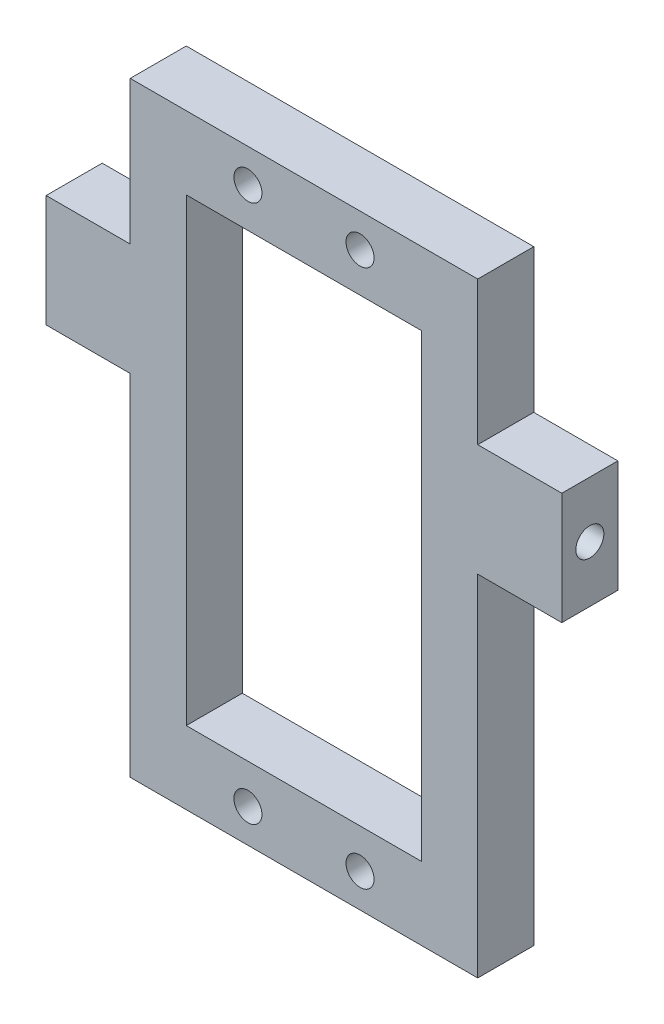
ISO-10303-21;
HEADER;
FILE_DESCRIPTION(('STEP AP214'),'2;1');
FILE_NAME('part.step','',(''),(''),'','','');
FILE_SCHEMA(('AUTOMOTIVE_DESIGN { 1 0 10303 214 1 1 1 1 }'));
ENDSEC;
DATA;
#1=APPLICATION_CONTEXT('core data for automotive mechanical design processes');
#2=APPLICATION_PROTOCOL_DEFINITION('international standard','automotive_design',2000,#1);
#3=PRODUCT_CONTEXT('',#1,'mechanical');
#4=PRODUCT('Part','Part','',(#3));
#5=PRODUCT_RELATED_PRODUCT_CATEGORY('part','',(#4));
#6=PRODUCT_DEFINITION_FORMATION('','',#4);
#7=PRODUCT_DEFINITION_CONTEXT('part definition',#1,'design');
#8=PRODUCT_DEFINITION('design','',#6,#7);
#9=PRODUCT_DEFINITION_SHAPE('','',#8);
#10=(LENGTH_UNIT() NAMED_UNIT(*) SI_UNIT(.MILLI.,.METRE.));
#11=(NAMED_UNIT(*) PLANE_ANGLE_UNIT() SI_UNIT($,.RADIAN.));
#12=(NAMED_UNIT(*) SI_UNIT($,.STERADIAN.) SOLID_ANGLE_UNIT());
#13=UNCERTAINTY_MEASURE_WITH_UNIT(LENGTH_MEASURE(1.E-05),#10,'distance_accuracy_value','');
#14=(GEOMETRIC_REPRESENTATION_CONTEXT(3) GLOBAL_UNCERTAINTY_ASSIGNED_CONTEXT((#13)) GLOBAL_UNIT_ASSIGNED_CONTEXT((#10,
#11,#12)) REPRESENTATION_CONTEXT('',''));
#15=CARTESIAN_POINT('',(0.,0.,0.));
#16=DIRECTION('',(0.,0.,1.));
#17=DIRECTION('',(1.,0.,0.));
#18=AXIS2_PLACEMENT_3D('',#15,#16,#17);
#19=CARTESIAN_POINT('',(-15.5,-27.,5.));
#20=DIRECTION('',(1.,0.,0.));
#21=DIRECTION('',(0.,0.,-1.));
#22=AXIS2_PLACEMENT_3D('',#19,#20,#21);
#23=PLANE('',#22);
#24=DIRECTION('',(0.,-1.,0.));
#25=VECTOR('',#24,1.);
#26=CARTESIAN_POINT('',(-15.5,-27.,5.));
#27=LINE('',#26,#25);
#28=CARTESIAN_POINT('',(-15.5,4.2,5.));
#29=VERTEX_POINT('',#28);
#30=CARTESIAN_POINT('',(-15.5,-27.,5.));
#31=VERTEX_POINT('',#30);
#32=EDGE_CURVE('E340',#29,#31,#27,.T.);
#33=ORIENTED_EDGE('',*,*,#32,.F.);
#34=DIRECTION('',(0.,0.,-1.));
#35=VECTOR('',#34,1.);
#36=CARTESIAN_POINT('',(-15.5,4.2,5.));
#37=LINE('',#36,#35);
#38=CARTESIAN_POINT('',(-15.5,4.2,0.));
#39=VERTEX_POINT('',#38);
#40=EDGE_CURVE('E229',#29,#39,#37,.T.);
#41=ORIENTED_EDGE('',*,*,#40,.T.);
#42=DIRECTION('',(0.,-1.,0.));
#43=VECTOR('',#42,1.);
#44=CARTESIAN_POINT('',(-15.5,-27.,0.));
#45=LINE('',#44,#43);
#46=CARTESIAN_POINT('',(-15.5,-27.,0.));
#47=VERTEX_POINT('',#46);
#48=EDGE_CURVE('E334',#39,#47,#45,.T.);
#49=ORIENTED_EDGE('',*,*,#48,.T.);
#50=DIRECTION('',(0.,0.,-1.));
#51=VECTOR('',#50,1.);
#52=CARTESIAN_POINT('',(-15.5,-27.,5.));
#53=LINE('',#52,#51);
#54=EDGE_CURVE('E11',#31,#47,#53,.T.);
#55=ORIENTED_EDGE('',*,*,#54,.F.);
#56=EDGE_LOOP('',(#33,#41,#49,#55));
#57=FACE_BOUND('',#56,.T.);
#58=ADVANCED_FACE('F46',(#57),#23,.F.);
#59=CARTESIAN_POINT('',(15.5,-27.,5.));
#60=DIRECTION('',(-1.,0.,0.));
#61=DIRECTION('',(0.,0.,1.));
#62=AXIS2_PLACEMENT_3D('',#59,#60,#61);
#63=PLANE('',#62);
#64=DIRECTION('',(0.,0.,1.));
#65=VECTOR('',#64,1.);
#66=CARTESIAN_POINT('',(15.5,14.2,0.));
#67=LINE('',#66,#65);
#68=CARTESIAN_POINT('',(15.5,14.2,0.));
#69=VERTEX_POINT('',#68);
#70=CARTESIAN_POINT('',(15.5,14.2,5.));
#71=VERTEX_POINT('',#70);
#72=EDGE_CURVE('E261',#69,#71,#67,.T.);
#73=ORIENTED_EDGE('',*,*,#72,.F.);
#74=DIRECTION('',(0.,1.,0.));
#75=VECTOR('',#74,1.);
#76=CARTESIAN_POINT('',(15.5,-27.,0.));
#77=LINE('',#76,#75);
#78=CARTESIAN_POINT('',(15.5,27.,0.));
#79=VERTEX_POINT('',#78);
#80=EDGE_CURVE('E358',#69,#79,#77,.T.);
#81=ORIENTED_EDGE('',*,*,#80,.T.);
#82=DIRECTION('',(0.,0.,-1.));
#83=VECTOR('',#82,1.);
#84=CARTESIAN_POINT('',(15.5,27.,5.));
#85=LINE('',#84,#83);
#86=CARTESIAN_POINT('',(15.5,27.,5.));
#87=VERTEX_POINT('',#86);
#88=EDGE_CURVE('E368',#87,#79,#85,.T.);
#89=ORIENTED_EDGE('',*,*,#88,.F.);
#90=DIRECTION('',(0.,1.,0.));
#91=VECTOR('',#90,1.);
#92=CARTESIAN_POINT('',(15.5,-27.,5.));
#93=LINE('',#92,#91);
#94=EDGE_CURVE('E70',#71,#87,#93,.T.);
#95=ORIENTED_EDGE('',*,*,#94,.F.);
#96=EDGE_LOOP('',(#73,#81,#89,#95));
#97=FACE_BOUND('',#96,.T.);
#98=ADVANCED_FACE('F406',(#97),#63,.F.);
#99=DIRECTION('',(0.,0.,-1.));
#100=VECTOR('',#99,1.);
#101=CARTESIAN_POINT('',(15.5,4.2,5.));
#102=LINE('',#101,#100);
#103=CARTESIAN_POINT('',(15.5,4.2,5.));
#104=VERTEX_POINT('',#103);
#105=CARTESIAN_POINT('',(15.5,4.2,0.));
#106=VERTEX_POINT('',#105);
#107=EDGE_CURVE('E255',#104,#106,#102,.T.);
#108=ORIENTED_EDGE('',*,*,#107,.F.);
#109=CARTESIAN_POINT('',(15.5,-27.,5.));
#110=VERTEX_POINT('',#109);
#111=EDGE_CURVE('E343',#110,#104,#93,.T.);
#112=ORIENTED_EDGE('',*,*,#111,.F.);
#113=DIRECTION('',(0.,0.,-1.));
#114=VECTOR('',#113,1.);
#115=CARTESIAN_POINT('',(15.5,-27.,5.));
#116=LINE('',#115,#114);
#117=CARTESIAN_POINT('',(15.5,-27.,0.));
#118=VERTEX_POINT('',#117);
#119=EDGE_CURVE('E55',#110,#118,#116,.T.);
#120=ORIENTED_EDGE('',*,*,#119,.T.);
#121=EDGE_CURVE('E359',#118,#106,#77,.T.);
#122=ORIENTED_EDGE('',*,*,#121,.T.);
#123=EDGE_LOOP('',(#108,#112,#120,#122));
#124=FACE_BOUND('',#123,.T.);
#125=ADVANCED_FACE('F378',(#124),#63,.F.);
#126=CARTESIAN_POINT('',(0.,0.,5.));
#127=DIRECTION('',(0.,0.,1.));
#128=DIRECTION('',(1.,0.,0.));
#129=AXIS2_PLACEMENT_3D('',#126,#127,#128);
#130=PLANE('',#129);
#131=CARTESIAN_POINT('',(5.00000000000002,-24.,5.));
#132=DIRECTION('',(0.,0.,-1.));
#133=DIRECTION('',(-1.,0.,0.));
#134=AXIS2_PLACEMENT_3D('',#131,#132,#133);
#135=CIRCLE('',#134,1.25);
#136=CARTESIAN_POINT('',(3.75000000000002,-24.,5.));
#137=VERTEX_POINT('',#136);
#138=EDGE_CURVE('E196',#137,#137,#135,.T.);
#139=ORIENTED_EDGE('',*,*,#138,.T.);
#140=EDGE_LOOP('',(#139));
#141=FACE_BOUND('',#140,.T.);
#142=CARTESIAN_POINT('',(-4.99999999999998,-24.,5.));
#143=DIRECTION('',(0.,0.,-1.));
#144=DIRECTION('',(-1.,0.,0.));
#145=AXIS2_PLACEMENT_3D('',#142,#143,#144);
#146=CIRCLE('',#145,1.25);
#147=CARTESIAN_POINT('',(-6.24999999999998,-24.,5.));
#148=VERTEX_POINT('',#147);
#149=EDGE_CURVE('E204',#148,#148,#146,.T.);
#150=ORIENTED_EDGE('',*,*,#149,.T.);
#151=EDGE_LOOP('',(#150));
#152=FACE_BOUND('',#151,.T.);
#153=CARTESIAN_POINT('',(5.00000000000001,24.,5.));
#154=DIRECTION('',(0.,0.,-1.));
#155=DIRECTION('',(-1.,0.,0.));
#156=AXIS2_PLACEMENT_3D('',#153,#154,#155);
#157=CIRCLE('',#156,1.25);
#158=CARTESIAN_POINT('',(3.75000000000002,24.,5.));
#159=VERTEX_POINT('',#158);
#160=EDGE_CURVE('E212',#159,#159,#157,.T.);
#161=ORIENTED_EDGE('',*,*,#160,.T.);
#162=EDGE_LOOP('',(#161));
#163=FACE_BOUND('',#162,.T.);
#164=CARTESIAN_POINT('',(-4.99999999999998,24.,5.));
#165=DIRECTION('',(0.,0.,-1.));
#166=DIRECTION('',(-1.,0.,0.));
#167=AXIS2_PLACEMENT_3D('',#164,#165,#166);
#168=CIRCLE('',#167,1.25);
#169=CARTESIAN_POINT('',(-6.24999999999998,24.,5.));
#170=VERTEX_POINT('',#169);
#171=EDGE_CURVE('E220',#170,#170,#168,.T.);
#172=ORIENTED_EDGE('',*,*,#171,.T.);
#173=EDGE_LOOP('',(#172));
#174=FACE_BOUND('',#173,.T.);
#175=CARTESIAN_POINT('',(-15.5,27.,5.));
#176=VERTEX_POINT('',#175);
#177=CARTESIAN_POINT('',(-15.5,14.2,5.));
#178=VERTEX_POINT('',#177);
#179=EDGE_CURVE('E335',#176,#178,#27,.T.);
#180=ORIENTED_EDGE('',*,*,#179,.T.);
#181=DIRECTION('',(1.,0.,0.));
#182=VECTOR('',#181,1.);
#183=CARTESIAN_POINT('',(-23.,14.2,5.));
#184=LINE('',#183,#182);
#185=CARTESIAN_POINT('',(-23.,14.2,5.));
#186=VERTEX_POINT('',#185);
#187=EDGE_CURVE('E62',#186,#178,#184,.T.);
#188=ORIENTED_EDGE('',*,*,#187,.F.);
#189=DIRECTION('',(0.,-1.,0.));
#190=VECTOR('',#189,1.);
#191=CARTESIAN_POINT('',(-23.,14.2,5.));
#192=LINE('',#191,#190);
#193=CARTESIAN_POINT('',(-23.,4.2,5.));
#194=VERTEX_POINT('',#193);
#195=EDGE_CURVE('E225',#186,#194,#192,.T.);
#196=ORIENTED_EDGE('',*,*,#195,.T.);
#197=DIRECTION('',(1.,0.,0.));
#198=VECTOR('',#197,1.);
#199=CARTESIAN_POINT('',(-23.,4.2,5.));
#200=LINE('',#199,#198);
#201=EDGE_CURVE('E239',#194,#29,#200,.T.);
#202=ORIENTED_EDGE('',*,*,#201,.T.);
#203=ORIENTED_EDGE('',*,*,#32,.T.);
#204=DIRECTION('',(1.,0.,0.));
#205=VECTOR('',#204,1.);
#206=CARTESIAN_POINT('',(15.5,-27.,5.));
#207=LINE('',#206,#205);
#208=EDGE_CURVE('E339',#31,#110,#207,.T.);
#209=ORIENTED_EDGE('',*,*,#208,.T.);
#210=ORIENTED_EDGE('',*,*,#111,.T.);
#211=DIRECTION('',(-1.,0.,0.));
#212=VECTOR('',#211,1.);
#213=CARTESIAN_POINT('',(23.,4.2,5.));
#214=LINE('',#213,#212);
#215=CARTESIAN_POINT('',(23.,4.2,5.));
#216=VERTEX_POINT('',#215);
#217=EDGE_CURVE('E287',#216,#104,#214,.T.);
#218=ORIENTED_EDGE('',*,*,#217,.F.);
#219=DIRECTION('',(0.,-1.,0.));
#220=VECTOR('',#219,1.);
#221=CARTESIAN_POINT('',(23.,14.2,5.));
#222=LINE('',#221,#220);
#223=CARTESIAN_POINT('',(23.,14.2,5.));
#224=VERTEX_POINT('',#223);
#225=EDGE_CURVE('E256',#224,#216,#222,.T.);
#226=ORIENTED_EDGE('',*,*,#225,.F.);
#227=DIRECTION('',(-1.,0.,0.));
#228=VECTOR('',#227,1.);
#229=CARTESIAN_POINT('',(23.,14.2,5.));
#230=LINE('',#229,#228);
#231=EDGE_CURVE('E270',#224,#71,#230,.T.);
#232=ORIENTED_EDGE('',*,*,#231,.T.);
#233=ORIENTED_EDGE('',*,*,#94,.T.);
#234=DIRECTION('',(-1.,0.,0.));
#235=VECTOR('',#234,1.);
#236=CARTESIAN_POINT('',(15.5,27.,5.));
#237=LINE('',#236,#235);
#238=EDGE_CURVE('E347',#87,#176,#237,.T.);
#239=ORIENTED_EDGE('',*,*,#238,.T.);
#240=EDGE_LOOP('',(#180,#188,#196,#202,#203,#209,#210,#218,#226,#232,#233,#239));
#241=FACE_BOUND('',#240,.T.);
#242=DIRECTION('',(1.,0.,0.));
#243=VECTOR('',#242,1.);
#244=CARTESIAN_POINT('',(10.5,-20.5,5.));
#245=LINE('',#244,#243);
#246=CARTESIAN_POINT('',(-10.5,-20.5,5.));
#247=VERTEX_POINT('',#246);
#248=CARTESIAN_POINT('',(10.5,-20.5,5.));
#249=VERTEX_POINT('',#248);
#250=EDGE_CURVE('E295',#247,#249,#245,.T.);
#251=ORIENTED_EDGE('',*,*,#250,.F.);
#252=DIRECTION('',(0.,-1.,0.));
#253=VECTOR('',#252,1.);
#254=CARTESIAN_POINT('',(-10.5,-20.5,5.));
#255=LINE('',#254,#253);
#256=CARTESIAN_POINT('',(-10.5,20.5,5.));
#257=VERTEX_POINT('',#256);
#258=EDGE_CURVE('E292',#257,#247,#255,.T.);
#259=ORIENTED_EDGE('',*,*,#258,.F.);
#260=DIRECTION('',(-1.,0.,0.));
#261=VECTOR('',#260,1.);
#262=CARTESIAN_POINT('',(10.5,20.5,5.));
#263=LINE('',#262,#261);
#264=CARTESIAN_POINT('',(10.5,20.5,5.));
#265=VERTEX_POINT('',#264);
#266=EDGE_CURVE('E303',#265,#257,#263,.T.);
#267=ORIENTED_EDGE('',*,*,#266,.F.);
#268=DIRECTION('',(0.,1.,0.));
#269=VECTOR('',#268,1.);
#270=CARTESIAN_POINT('',(10.5,-20.5,5.));
#271=LINE('',#270,#269);
#272=EDGE_CURVE('E299',#249,#265,#271,.T.);
#273=ORIENTED_EDGE('',*,*,#272,.F.);
#274=EDGE_LOOP('',(#251,#259,#267,#273));
#275=FACE_BOUND('',#274,.T.);
#276=ADVANCED_FACE('F394',(#141,#152,#163,#174,#241,#275),#130,.T.);
#277=CARTESIAN_POINT('',(0.,0.,0.));
#278=DIRECTION('',(0.,0.,1.));
#279=DIRECTION('',(1.,0.,0.));
#280=AXIS2_PLACEMENT_3D('',#277,#278,#279);
#281=PLANE('',#280);
#282=CARTESIAN_POINT('',(5.00000000000002,-24.,0.));
#283=DIRECTION('',(0.,0.,-1.));
#284=DIRECTION('',(-1.,0.,0.));
#285=AXIS2_PLACEMENT_3D('',#282,#283,#284);
#286=CIRCLE('',#285,1.25);
#287=CARTESIAN_POINT('',(3.75000000000002,-24.,0.));
#288=VERTEX_POINT('',#287);
#289=EDGE_CURVE('E192',#288,#288,#286,.T.);
#290=ORIENTED_EDGE('',*,*,#289,.F.);
#291=EDGE_LOOP('',(#290));
#292=FACE_BOUND('',#291,.T.);
#293=CARTESIAN_POINT('',(-4.99999999999998,-24.,0.));
#294=DIRECTION('',(0.,0.,-1.));
#295=DIRECTION('',(-1.,0.,0.));
#296=AXIS2_PLACEMENT_3D('',#293,#294,#295);
#297=CIRCLE('',#296,1.25);
#298=CARTESIAN_POINT('',(-6.24999999999998,-24.,0.));
#299=VERTEX_POINT('',#298);
#300=EDGE_CURVE('E200',#299,#299,#297,.T.);
#301=ORIENTED_EDGE('',*,*,#300,.F.);
#302=EDGE_LOOP('',(#301));
#303=FACE_BOUND('',#302,.T.);
#304=CARTESIAN_POINT('',(5.00000000000001,24.,0.));
#305=DIRECTION('',(0.,0.,-1.));
#306=DIRECTION('',(-1.,0.,0.));
#307=AXIS2_PLACEMENT_3D('',#304,#305,#306);
#308=CIRCLE('',#307,1.25);
#309=CARTESIAN_POINT('',(3.75000000000002,24.,0.));
#310=VERTEX_POINT('',#309);
#311=EDGE_CURVE('E208',#310,#310,#308,.T.);
#312=ORIENTED_EDGE('',*,*,#311,.F.);
#313=EDGE_LOOP('',(#312));
#314=FACE_BOUND('',#313,.T.);
#315=CARTESIAN_POINT('',(-4.99999999999998,24.,0.));
#316=DIRECTION('',(0.,0.,-1.));
#317=DIRECTION('',(-1.,0.,0.));
#318=AXIS2_PLACEMENT_3D('',#315,#316,#317);
#319=CIRCLE('',#318,1.25);
#320=CARTESIAN_POINT('',(-6.24999999999998,24.,0.));
#321=VERTEX_POINT('',#320);
#322=EDGE_CURVE('E216',#321,#321,#319,.T.);
#323=ORIENTED_EDGE('',*,*,#322,.F.);
#324=EDGE_LOOP('',(#323));
#325=FACE_BOUND('',#324,.T.);
#326=CARTESIAN_POINT('',(-15.5,27.,0.));
#327=VERTEX_POINT('',#326);
#328=CARTESIAN_POINT('',(-15.5,14.2,0.));
#329=VERTEX_POINT('',#328);
#330=EDGE_CURVE('E351',#327,#329,#45,.T.);
#331=ORIENTED_EDGE('',*,*,#330,.F.);
#332=DIRECTION('',(-1.,0.,0.));
#333=VECTOR('',#332,1.);
#334=CARTESIAN_POINT('',(15.5,27.,0.));
#335=LINE('',#334,#333);
#336=EDGE_CURVE('E362',#79,#327,#335,.T.);
#337=ORIENTED_EDGE('',*,*,#336,.F.);
#338=ORIENTED_EDGE('',*,*,#80,.F.);
#339=DIRECTION('',(-1.,0.,0.));
#340=VECTOR('',#339,1.);
#341=CARTESIAN_POINT('',(23.,14.2,0.));
#342=LINE('',#341,#340);
#343=CARTESIAN_POINT('',(23.,14.2,0.));
#344=VERTEX_POINT('',#343);
#345=EDGE_CURVE('E279',#344,#69,#342,.T.);
#346=ORIENTED_EDGE('',*,*,#345,.F.);
#347=DIRECTION('',(0.,1.,0.));
#348=VECTOR('',#347,1.);
#349=CARTESIAN_POINT('',(23.,4.2,0.));
#350=LINE('',#349,#348);
#351=CARTESIAN_POINT('',(23.,4.2,0.));
#352=VERTEX_POINT('',#351);
#353=EDGE_CURVE('E264',#352,#344,#350,.T.);
#354=ORIENTED_EDGE('',*,*,#353,.F.);
#355=DIRECTION('',(-1.,0.,0.));
#356=VECTOR('',#355,1.);
#357=CARTESIAN_POINT('',(23.,4.2,0.));
#358=LINE('',#357,#356);
#359=EDGE_CURVE('E283',#352,#106,#358,.T.);
#360=ORIENTED_EDGE('',*,*,#359,.T.);
#361=ORIENTED_EDGE('',*,*,#121,.F.);
#362=DIRECTION('',(1.,0.,0.));
#363=VECTOR('',#362,1.);
#364=CARTESIAN_POINT('',(15.5,-27.,0.));
#365=LINE('',#364,#363);
#366=EDGE_CURVE('E355',#47,#118,#365,.T.);
#367=ORIENTED_EDGE('',*,*,#366,.F.);
#368=ORIENTED_EDGE('',*,*,#48,.F.);
#369=DIRECTION('',(1.,0.,0.));
#370=VECTOR('',#369,1.);
#371=CARTESIAN_POINT('',(-23.,4.2,0.));
#372=LINE('',#371,#370);
#373=CARTESIAN_POINT('',(-23.,4.2,0.));
#374=VERTEX_POINT('',#373);
#375=EDGE_CURVE('E247',#374,#39,#372,.T.);
#376=ORIENTED_EDGE('',*,*,#375,.F.);
#377=DIRECTION('',(0.,1.,0.));
#378=VECTOR('',#377,1.);
#379=CARTESIAN_POINT('',(-23.,4.2,0.));
#380=LINE('',#379,#378);
#381=CARTESIAN_POINT('',(-23.,14.2,0.));
#382=VERTEX_POINT('',#381);
#383=EDGE_CURVE('E231',#374,#382,#380,.T.);
#384=ORIENTED_EDGE('',*,*,#383,.T.);
#385=DIRECTION('',(1.,0.,0.));
#386=VECTOR('',#385,1.);
#387=CARTESIAN_POINT('',(-23.,14.2,0.));
#388=LINE('',#387,#386);
#389=EDGE_CURVE('E250',#382,#329,#388,.T.);
#390=ORIENTED_EDGE('',*,*,#389,.T.);
#391=EDGE_LOOP('',(#331,#337,#338,#346,#354,#360,#361,#367,#368,#376,#384,#390));
#392=FACE_BOUND('',#391,.T.);
#393=DIRECTION('',(0.,-1.,0.));
#394=VECTOR('',#393,1.);
#395=CARTESIAN_POINT('',(-10.5,-20.5,0.));
#396=LINE('',#395,#394);
#397=CARTESIAN_POINT('',(-10.5,20.5,0.));
#398=VERTEX_POINT('',#397);
#399=CARTESIAN_POINT('',(-10.5,-20.5,0.));
#400=VERTEX_POINT('',#399);
#401=EDGE_CURVE('E291',#398,#400,#396,.T.);
#402=ORIENTED_EDGE('',*,*,#401,.T.);
#403=DIRECTION('',(1.,0.,0.));
#404=VECTOR('',#403,1.);
#405=CARTESIAN_POINT('',(10.5,-20.5,0.));
#406=LINE('',#405,#404);
#407=CARTESIAN_POINT('',(10.5,-20.5,0.));
#408=VERTEX_POINT('',#407);
#409=EDGE_CURVE('E310',#400,#408,#406,.T.);
#410=ORIENTED_EDGE('',*,*,#409,.T.);
#411=DIRECTION('',(0.,1.,0.));
#412=VECTOR('',#411,1.);
#413=CARTESIAN_POINT('',(10.5,-20.5,0.));
#414=LINE('',#413,#412);
#415=CARTESIAN_POINT('',(10.5,20.5,0.));
#416=VERTEX_POINT('',#415);
#417=EDGE_CURVE('E314',#408,#416,#414,.T.);
#418=ORIENTED_EDGE('',*,*,#417,.T.);
#419=DIRECTION('',(-1.,0.,0.));
#420=VECTOR('',#419,1.);
#421=CARTESIAN_POINT('',(10.5,20.5,0.));
#422=LINE('',#421,#420);
#423=EDGE_CURVE('E296',#416,#398,#422,.T.);
#424=ORIENTED_EDGE('',*,*,#423,.T.);
#425=EDGE_LOOP('',(#402,#410,#418,#424));
#426=FACE_BOUND('',#425,.T.);
#427=ADVANCED_FACE('F384',(#292,#303,#314,#325,#392,#426),#281,.F.);
#428=ORIENTED_EDGE('',*,*,#330,.T.);
#429=DIRECTION('',(0.,0.,1.));
#430=VECTOR('',#429,1.);
#431=CARTESIAN_POINT('',(-15.5,14.2,0.));
#432=LINE('',#431,#430);
#433=EDGE_CURVE('E224',#329,#178,#432,.T.);
#434=ORIENTED_EDGE('',*,*,#433,.T.);
#435=ORIENTED_EDGE('',*,*,#179,.F.);
#436=DIRECTION('',(0.,0.,-1.));
#437=VECTOR('',#436,1.);
#438=CARTESIAN_POINT('',(-15.5,27.,5.));
#439=LINE('',#438,#437);
#440=EDGE_CURVE('E350',#176,#327,#439,.T.);
#441=ORIENTED_EDGE('',*,*,#440,.T.);
#442=EDGE_LOOP('',(#428,#434,#435,#441));
#443=FACE_BOUND('',#442,.T.);
#444=ADVANCED_FACE('F48',(#443),#23,.F.);
#445=CARTESIAN_POINT('',(15.5,-27.,5.));
#446=DIRECTION('',(0.,1.,0.));
#447=DIRECTION('',(0.,0.,1.));
#448=AXIS2_PLACEMENT_3D('',#445,#446,#447);
#449=PLANE('',#448);
#450=ORIENTED_EDGE('',*,*,#366,.T.);
#451=ORIENTED_EDGE('',*,*,#119,.F.);
#452=ORIENTED_EDGE('',*,*,#208,.F.);
#453=ORIENTED_EDGE('',*,*,#54,.T.);
#454=EDGE_LOOP('',(#450,#451,#452,#453));
#455=FACE_BOUND('',#454,.T.);
#456=ADVANCED_FACE('F399',(#455),#449,.F.);
#457=CARTESIAN_POINT('',(15.5,27.,5.));
#458=DIRECTION('',(0.,-1.,0.));
#459=DIRECTION('',(0.,0.,-1.));
#460=AXIS2_PLACEMENT_3D('',#457,#458,#459);
#461=PLANE('',#460);
#462=ORIENTED_EDGE('',*,*,#336,.T.);
#463=ORIENTED_EDGE('',*,*,#440,.F.);
#464=ORIENTED_EDGE('',*,*,#238,.F.);
#465=ORIENTED_EDGE('',*,*,#88,.T.);
#466=EDGE_LOOP('',(#462,#463,#464,#465));
#467=FACE_BOUND('',#466,.T.);
#468=ADVANCED_FACE('F410',(#467),#461,.F.);
#469=CARTESIAN_POINT('',(-10.5,-20.5,5.));
#470=DIRECTION('',(1.,0.,0.));
#471=DIRECTION('',(0.,0.,-1.));
#472=AXIS2_PLACEMENT_3D('',#469,#470,#471);
#473=PLANE('',#472);
#474=ORIENTED_EDGE('',*,*,#401,.F.);
#475=DIRECTION('',(0.,0.,-1.));
#476=VECTOR('',#475,1.);
#477=CARTESIAN_POINT('',(-10.5,20.5,5.));
#478=LINE('',#477,#476);
#479=EDGE_CURVE('E306',#257,#398,#478,.T.);
#480=ORIENTED_EDGE('',*,*,#479,.F.);
#481=ORIENTED_EDGE('',*,*,#258,.T.);
#482=DIRECTION('',(0.,0.,-1.));
#483=VECTOR('',#482,1.);
#484=CARTESIAN_POINT('',(-10.5,-20.5,5.));
#485=LINE('',#484,#483);
#486=EDGE_CURVE('E330',#247,#400,#485,.T.);
#487=ORIENTED_EDGE('',*,*,#486,.T.);
#488=EDGE_LOOP('',(#474,#480,#481,#487));
#489=FACE_BOUND('',#488,.T.);
#490=ADVANCED_FACE('F455',(#489),#473,.T.);
#491=CARTESIAN_POINT('',(10.5,-20.5,5.));
#492=DIRECTION('',(0.,1.,0.));
#493=DIRECTION('',(0.,0.,1.));
#494=AXIS2_PLACEMENT_3D('',#491,#492,#493);
#495=PLANE('',#494);
#496=ORIENTED_EDGE('',*,*,#409,.F.);
#497=ORIENTED_EDGE('',*,*,#486,.F.);
#498=ORIENTED_EDGE('',*,*,#250,.T.);
#499=DIRECTION('',(0.,0.,-1.));
#500=VECTOR('',#499,1.);
#501=CARTESIAN_POINT('',(10.5,-20.5,5.));
#502=LINE('',#501,#500);
#503=EDGE_CURVE('E327',#249,#408,#502,.T.);
#504=ORIENTED_EDGE('',*,*,#503,.T.);
#505=EDGE_LOOP('',(#496,#497,#498,#504));
#506=FACE_BOUND('',#505,.T.);
#507=ADVANCED_FACE('F459',(#506),#495,.T.);
#508=CARTESIAN_POINT('',(10.5,-20.5,5.));
#509=DIRECTION('',(-1.,0.,0.));
#510=DIRECTION('',(0.,0.,1.));
#511=AXIS2_PLACEMENT_3D('',#508,#509,#510);
#512=PLANE('',#511);
#513=ORIENTED_EDGE('',*,*,#417,.F.);
#514=ORIENTED_EDGE('',*,*,#503,.F.);
#515=ORIENTED_EDGE('',*,*,#272,.T.);
#516=DIRECTION('',(0.,0.,-1.));
#517=VECTOR('',#516,1.);
#518=CARTESIAN_POINT('',(10.5,20.5,5.));
#519=LINE('',#518,#517);
#520=EDGE_CURVE('E324',#265,#416,#519,.T.);
#521=ORIENTED_EDGE('',*,*,#520,.T.);
#522=EDGE_LOOP('',(#513,#514,#515,#521));
#523=FACE_BOUND('',#522,.T.);
#524=ADVANCED_FACE('F464',(#523),#512,.T.);
#525=CARTESIAN_POINT('',(10.5,20.5,5.));
#526=DIRECTION('',(0.,-1.,0.));
#527=DIRECTION('',(0.,0.,-1.));
#528=AXIS2_PLACEMENT_3D('',#525,#526,#527);
#529=PLANE('',#528);
#530=ORIENTED_EDGE('',*,*,#423,.F.);
#531=ORIENTED_EDGE('',*,*,#520,.F.);
#532=ORIENTED_EDGE('',*,*,#266,.T.);
#533=ORIENTED_EDGE('',*,*,#479,.T.);
#534=EDGE_LOOP('',(#530,#531,#532,#533));
#535=FACE_BOUND('',#534,.T.);
#536=ADVANCED_FACE('F470',(#535),#529,.T.);
#537=CARTESIAN_POINT('',(23.,4.2,5.));
#538=DIRECTION('',(0.,1.,0.));
#539=DIRECTION('',(0.,0.,1.));
#540=AXIS2_PLACEMENT_3D('',#537,#538,#539);
#541=PLANE('',#540);
#542=ORIENTED_EDGE('',*,*,#107,.T.);
#543=ORIENTED_EDGE('',*,*,#359,.F.);
#544=DIRECTION('',(0.,0.,-1.));
#545=VECTOR('',#544,1.);
#546=CARTESIAN_POINT('',(23.,4.2,5.));
#547=LINE('',#546,#545);
#548=EDGE_CURVE('E260',#216,#352,#547,.T.);
#549=ORIENTED_EDGE('',*,*,#548,.F.);
#550=ORIENTED_EDGE('',*,*,#217,.T.);
#551=EDGE_LOOP('',(#542,#543,#549,#550));
#552=FACE_BOUND('',#551,.T.);
#553=ADVANCED_FACE('F391',(#552),#541,.F.);
#554=CARTESIAN_POINT('',(23.,14.2,0.));
#555=DIRECTION('',(0.,-1.,0.));
#556=DIRECTION('',(0.,0.,-1.));
#557=AXIS2_PLACEMENT_3D('',#554,#555,#556);
#558=PLANE('',#557);
#559=ORIENTED_EDGE('',*,*,#72,.T.);
#560=ORIENTED_EDGE('',*,*,#231,.F.);
#561=DIRECTION('',(0.,0.,1.));
#562=VECTOR('',#561,1.);
#563=CARTESIAN_POINT('',(23.,14.2,0.));
#564=LINE('',#563,#562);
#565=EDGE_CURVE('E267',#344,#224,#564,.T.);
#566=ORIENTED_EDGE('',*,*,#565,.F.);
#567=ORIENTED_EDGE('',*,*,#345,.T.);
#568=EDGE_LOOP('',(#559,#560,#566,#567));
#569=FACE_BOUND('',#568,.T.);
#570=ADVANCED_FACE('F418',(#569),#558,.F.);
#571=CARTESIAN_POINT('',(23.,0.,0.));
#572=DIRECTION('',(1.,0.,0.));
#573=DIRECTION('',(0.,0.,-1.));
#574=AXIS2_PLACEMENT_3D('',#571,#572,#573);
#575=PLANE('',#574);
#576=CARTESIAN_POINT('',(23.,9.2,2.5));
#577=DIRECTION('',(1.,0.,0.));
#578=DIRECTION('',(0.,0.,-1.));
#579=AXIS2_PLACEMENT_3D('',#576,#577,#578);
#580=CIRCLE('',#579,1.24999999999999);
#581=CARTESIAN_POINT('',(23.,9.2,1.25000000000001));
#582=VERTEX_POINT('',#581);
#583=EDGE_CURVE('E176',#582,#582,#580,.T.);
#584=ORIENTED_EDGE('',*,*,#583,.F.);
#585=EDGE_LOOP('',(#584));
#586=FACE_BOUND('',#585,.T.);
#587=ORIENTED_EDGE('',*,*,#225,.T.);
#588=ORIENTED_EDGE('',*,*,#548,.T.);
#589=ORIENTED_EDGE('',*,*,#353,.T.);
#590=ORIENTED_EDGE('',*,*,#565,.T.);
#591=EDGE_LOOP('',(#587,#588,#589,#590));
#592=FACE_BOUND('',#591,.T.);
#593=ADVANCED_FACE('F420',(#586,#592),#575,.T.);
#594=CARTESIAN_POINT('',(-23.,14.2,0.));
#595=DIRECTION('',(0.,1.,0.));
#596=DIRECTION('',(0.,0.,1.));
#597=AXIS2_PLACEMENT_3D('',#594,#595,#596);
#598=PLANE('',#597);
#599=ORIENTED_EDGE('',*,*,#433,.F.);
#600=ORIENTED_EDGE('',*,*,#389,.F.);
#601=DIRECTION('',(0.,0.,1.));
#602=VECTOR('',#601,1.);
#603=CARTESIAN_POINT('',(-23.,14.2,0.));
#604=LINE('',#603,#602);
#605=EDGE_CURVE('E228',#382,#186,#604,.T.);
#606=ORIENTED_EDGE('',*,*,#605,.T.);
#607=ORIENTED_EDGE('',*,*,#187,.T.);
#608=EDGE_LOOP('',(#599,#600,#606,#607));
#609=FACE_BOUND('',#608,.T.);
#610=ADVANCED_FACE('F422',(#609),#598,.T.);
#611=CARTESIAN_POINT('',(-23.,4.2,5.));
#612=DIRECTION('',(0.,-1.,0.));
#613=DIRECTION('',(0.,0.,-1.));
#614=AXIS2_PLACEMENT_3D('',#611,#612,#613);
#615=PLANE('',#614);
#616=ORIENTED_EDGE('',*,*,#40,.F.);
#617=ORIENTED_EDGE('',*,*,#201,.F.);
#618=DIRECTION('',(0.,0.,-1.));
#619=VECTOR('',#618,1.);
#620=CARTESIAN_POINT('',(-23.,4.2,5.));
#621=LINE('',#620,#619);
#622=EDGE_CURVE('E235',#194,#374,#621,.T.);
#623=ORIENTED_EDGE('',*,*,#622,.T.);
#624=ORIENTED_EDGE('',*,*,#375,.T.);
#625=EDGE_LOOP('',(#616,#617,#623,#624));
#626=FACE_BOUND('',#625,.T.);
#627=ADVANCED_FACE('F429',(#626),#615,.T.);
#628=CARTESIAN_POINT('',(-23.,0.,0.));
#629=DIRECTION('',(-1.,0.,0.));
#630=DIRECTION('',(0.,0.,-1.));
#631=AXIS2_PLACEMENT_3D('',#628,#629,#630);
#632=PLANE('',#631);
#633=CARTESIAN_POINT('',(-23.,9.2,2.5));
#634=DIRECTION('',(-1.,0.,0.));
#635=DIRECTION('',(0.,0.,1.));
#636=AXIS2_PLACEMENT_3D('',#633,#634,#635);
#637=CIRCLE('',#636,1.24999999999999);
#638=CARTESIAN_POINT('',(-23.,9.2,3.74999999999999));
#639=VERTEX_POINT('',#638);
#640=EDGE_CURVE('E177',#639,#639,#637,.T.);
#641=ORIENTED_EDGE('',*,*,#640,.F.);
#642=EDGE_LOOP('',(#641));
#643=FACE_BOUND('',#642,.T.);
#644=ORIENTED_EDGE('',*,*,#195,.F.);
#645=ORIENTED_EDGE('',*,*,#605,.F.);
#646=ORIENTED_EDGE('',*,*,#383,.F.);
#647=ORIENTED_EDGE('',*,*,#622,.F.);
#648=EDGE_LOOP('',(#644,#645,#646,#647));
#649=FACE_BOUND('',#648,.T.);
#650=ADVANCED_FACE('F502',(#643,#649),#632,.T.);
#651=CARTESIAN_POINT('',(-4.99999999999998,24.,0.));
#652=DIRECTION('',(0.,0.,-1.));
#653=DIRECTION('',(-1.,0.,0.));
#654=AXIS2_PLACEMENT_3D('',#651,#652,#653);
#655=CYLINDRICAL_SURFACE('',#654,1.25);
#656=ORIENTED_EDGE('',*,*,#171,.F.);
#657=EDGE_LOOP('',(#656));
#658=FACE_BOUND('',#657,.T.);
#659=ORIENTED_EDGE('',*,*,#322,.T.);
#660=EDGE_LOOP('',(#659));
#661=FACE_BOUND('',#660,.T.);
#662=ADVANCED_FACE('F512',(#658,#661),#655,.F.);
#663=CARTESIAN_POINT('',(5.00000000000001,24.,0.));
#664=DIRECTION('',(0.,0.,-1.));
#665=DIRECTION('',(-1.,0.,0.));
#666=AXIS2_PLACEMENT_3D('',#663,#664,#665);
#667=CYLINDRICAL_SURFACE('',#666,1.25);
#668=ORIENTED_EDGE('',*,*,#160,.F.);
#669=EDGE_LOOP('',(#668));
#670=FACE_BOUND('',#669,.T.);
#671=ORIENTED_EDGE('',*,*,#311,.T.);
#672=EDGE_LOOP('',(#671));
#673=FACE_BOUND('',#672,.T.);
#674=ADVANCED_FACE('F523',(#670,#673),#667,.F.);
#675=CARTESIAN_POINT('',(-4.99999999999998,-24.,0.));
#676=DIRECTION('',(0.,0.,-1.));
#677=DIRECTION('',(-1.,0.,0.));
#678=AXIS2_PLACEMENT_3D('',#675,#676,#677);
#679=CYLINDRICAL_SURFACE('',#678,1.25);
#680=ORIENTED_EDGE('',*,*,#149,.F.);
#681=EDGE_LOOP('',(#680));
#682=FACE_BOUND('',#681,.T.);
#683=ORIENTED_EDGE('',*,*,#300,.T.);
#684=EDGE_LOOP('',(#683));
#685=FACE_BOUND('',#684,.T.);
#686=ADVANCED_FACE('F533',(#682,#685),#679,.F.);
#687=CARTESIAN_POINT('',(5.00000000000002,-24.,0.));
#688=DIRECTION('',(0.,0.,-1.));
#689=DIRECTION('',(-1.,0.,0.));
#690=AXIS2_PLACEMENT_3D('',#687,#688,#689);
#691=CYLINDRICAL_SURFACE('',#690,1.25);
#692=ORIENTED_EDGE('',*,*,#138,.F.);
#693=EDGE_LOOP('',(#692));
#694=FACE_BOUND('',#693,.T.);
#695=ORIENTED_EDGE('',*,*,#289,.T.);
#696=EDGE_LOOP('',(#695));
#697=FACE_BOUND('',#696,.T.);
#698=ADVANCED_FACE('F542',(#694,#697),#691,.F.);
#699=CARTESIAN_POINT('',(17.5,9.2,2.5));
#700=DIRECTION('',(1.,0.,0.));
#701=DIRECTION('',(0.,0.,-1.));
#702=AXIS2_PLACEMENT_3D('',#699,#700,#701);
#703=CONICAL_SURFACE('',#702,1.24999999999999,1.02974425867665);
#704=CARTESIAN_POINT('',(16.7489242262155,9.2,2.5));
#705=VERTEX_POINT('',#704);
#706=VERTEX_LOOP('',#705);
#707=FACE_BOUND('',#706,.T.);
#708=CARTESIAN_POINT('',(17.5,9.2,2.5));
#709=DIRECTION('',(1.,0.,0.));
#710=DIRECTION('',(0.,0.,-1.));
#711=AXIS2_PLACEMENT_3D('',#708,#709,#710);
#712=CIRCLE('',#711,1.24999999999999);
#713=CARTESIAN_POINT('',(17.5,9.2,1.25000000000001));
#714=VERTEX_POINT('',#713);
#715=EDGE_CURVE('E183',#714,#714,#712,.T.);
#716=ORIENTED_EDGE('',*,*,#715,.T.);
#717=EDGE_LOOP('',(#716));
#718=FACE_BOUND('',#717,.T.);
#719=ADVANCED_FACE('F551',(#707,#718),#703,.F.);
#720=CARTESIAN_POINT('',(23.,9.2,2.5));
#721=DIRECTION('',(1.,0.,0.));
#722=DIRECTION('',(0.,0.,-1.));
#723=AXIS2_PLACEMENT_3D('',#720,#721,#722);
#724=CYLINDRICAL_SURFACE('',#723,1.24999999999999);
#725=ORIENTED_EDGE('',*,*,#715,.F.);
#726=EDGE_LOOP('',(#725));
#727=FACE_BOUND('',#726,.T.);
#728=ORIENTED_EDGE('',*,*,#583,.T.);
#729=EDGE_LOOP('',(#728));
#730=FACE_BOUND('',#729,.T.);
#731=ADVANCED_FACE('F169',(#727,#730),#724,.F.);
#732=CARTESIAN_POINT('',(-17.5,9.2,2.5));
#733=DIRECTION('',(-1.,0.,0.));
#734=DIRECTION('',(0.,0.,1.));
#735=AXIS2_PLACEMENT_3D('',#732,#733,#734);
#736=CONICAL_SURFACE('',#735,1.24999999999999,1.02974425867665);
#737=CARTESIAN_POINT('',(-16.7489242262155,9.2,2.5));
#738=VERTEX_POINT('',#737);
#739=VERTEX_LOOP('',#738);
#740=FACE_BOUND('',#739,.T.);
#741=CARTESIAN_POINT('',(-17.5,9.2,2.5));
#742=DIRECTION('',(-1.,0.,0.));
#743=DIRECTION('',(0.,0.,1.));
#744=AXIS2_PLACEMENT_3D('',#741,#742,#743);
#745=CIRCLE('',#744,1.24999999999999);
#746=CARTESIAN_POINT('',(-17.5,9.2,3.74999999999999));
#747=VERTEX_POINT('',#746);
#748=EDGE_CURVE('E173',#747,#747,#745,.T.);
#749=ORIENTED_EDGE('',*,*,#748,.T.);
#750=EDGE_LOOP('',(#749));
#751=FACE_BOUND('',#750,.T.);
#752=ADVANCED_FACE('F165',(#740,#751),#736,.F.);
#753=CARTESIAN_POINT('',(-23.,9.2,2.5));
#754=DIRECTION('',(-1.,0.,0.));
#755=DIRECTION('',(0.,0.,1.));
#756=AXIS2_PLACEMENT_3D('',#753,#754,#755);
#757=CYLINDRICAL_SURFACE('',#756,1.24999999999999);
#758=ORIENTED_EDGE('',*,*,#748,.F.);
#759=EDGE_LOOP('',(#758));
#760=FACE_BOUND('',#759,.T.);
#761=ORIENTED_EDGE('',*,*,#640,.T.);
#762=EDGE_LOOP('',(#761));
#763=FACE_BOUND('',#762,.T.);
#764=ADVANCED_FACE('F168',(#760,#763),#757,.F.);
#765=CLOSED_SHELL('',(#58,#98,#125,#276,#427,#444,#456,#468,#490,#507,#524,#536,#553,#570,#593,
#610,#627,#650,#662,#674,#686,#698,#719,#731,#752,#764));
#766=MANIFOLD_SOLID_BREP('B2',#765);
#767=ADVANCED_BREP_SHAPE_REPRESENTATION('',(#18,#766),#14);
#768=SHAPE_DEFINITION_REPRESENTATION(#9,#767);
ENDSEC;
END-ISO-10303-21;
